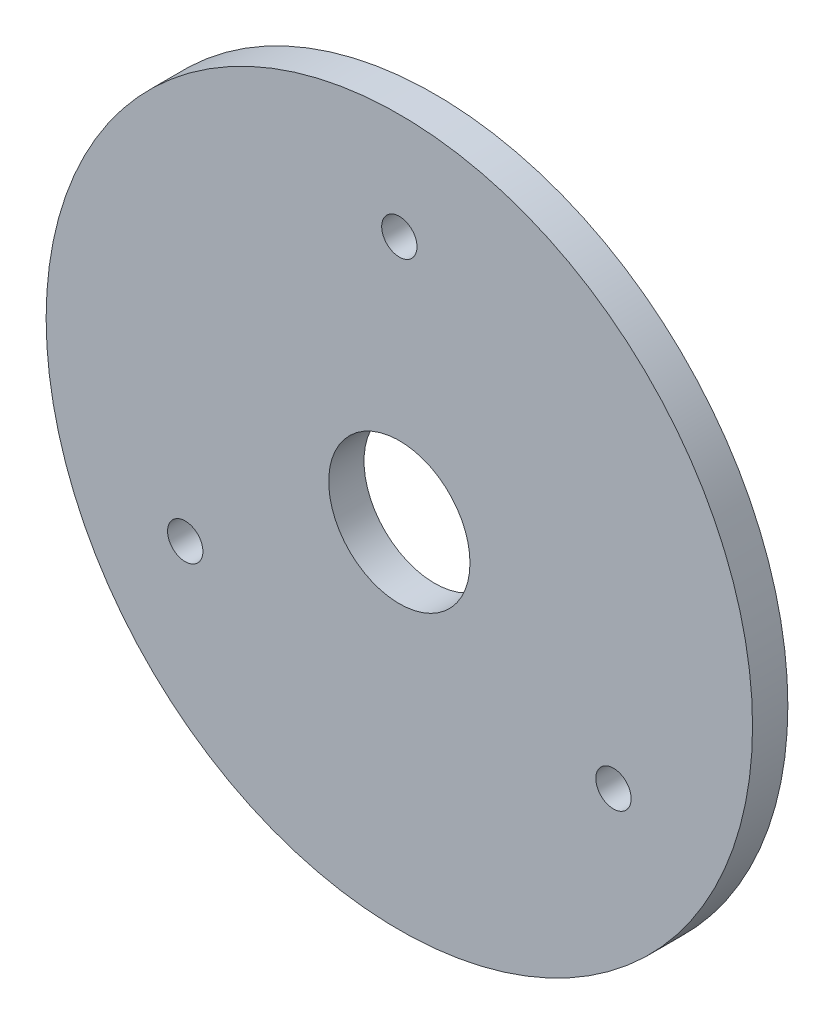
ISO-10303-21;
HEADER;
FILE_DESCRIPTION(('STEP AP214'),'2;1');
FILE_NAME('part.step','',(''),(''),'','','');
FILE_SCHEMA(('AUTOMOTIVE_DESIGN { 1 0 10303 214 1 1 1 1 }'));
ENDSEC;
DATA;
#1=APPLICATION_CONTEXT('core data for automotive mechanical design processes');
#2=APPLICATION_PROTOCOL_DEFINITION('international standard','automotive_design',2000,#1);
#3=PRODUCT_CONTEXT('',#1,'mechanical');
#4=PRODUCT('Part','Part','',(#3));
#5=PRODUCT_RELATED_PRODUCT_CATEGORY('part','',(#4));
#6=PRODUCT_DEFINITION_FORMATION('','',#4);
#7=PRODUCT_DEFINITION_CONTEXT('part definition',#1,'design');
#8=PRODUCT_DEFINITION('design','',#6,#7);
#9=PRODUCT_DEFINITION_SHAPE('','',#8);
#10=(LENGTH_UNIT() NAMED_UNIT(*) SI_UNIT(.MILLI.,.METRE.));
#11=(NAMED_UNIT(*) PLANE_ANGLE_UNIT() SI_UNIT($,.RADIAN.));
#12=(NAMED_UNIT(*) SI_UNIT($,.STERADIAN.) SOLID_ANGLE_UNIT());
#13=UNCERTAINTY_MEASURE_WITH_UNIT(LENGTH_MEASURE(1.E-05),#10,'distance_accuracy_value','');
#14=(GEOMETRIC_REPRESENTATION_CONTEXT(3) GLOBAL_UNCERTAINTY_ASSIGNED_CONTEXT((#13)) GLOBAL_UNIT_ASSIGNED_CONTEXT((#10,
#11,#12)) REPRESENTATION_CONTEXT('',''));
#15=CARTESIAN_POINT('',(0.,0.,0.));
#16=DIRECTION('',(0.,0.,1.));
#17=DIRECTION('',(1.,0.,0.));
#18=AXIS2_PLACEMENT_3D('',#15,#16,#17);
#19=CARTESIAN_POINT('',(0.,0.,2.));
#20=DIRECTION('',(0.,0.,-1.));
#21=DIRECTION('',(-1.,0.,0.));
#22=AXIS2_PLACEMENT_3D('',#19,#20,#21);
#23=CYLINDRICAL_SURFACE('',#22,20.);
#24=CARTESIAN_POINT('',(0.,0.,2.));
#25=DIRECTION('',(0.,0.,1.));
#26=DIRECTION('',(1.,0.,0.));
#27=AXIS2_PLACEMENT_3D('',#24,#25,#26);
#28=CIRCLE('',#27,20.);
#29=CARTESIAN_POINT('',(20.,0.,2.));
#30=VERTEX_POINT('',#29);
#31=EDGE_CURVE('E10',#30,#30,#28,.T.);
#32=ORIENTED_EDGE('',*,*,#31,.F.);
#33=EDGE_LOOP('',(#32));
#34=FACE_BOUND('',#33,.T.);
#35=CARTESIAN_POINT('',(0.,0.,0.));
#36=DIRECTION('',(0.,0.,1.));
#37=DIRECTION('',(1.,0.,0.));
#38=AXIS2_PLACEMENT_3D('',#35,#36,#37);
#39=CIRCLE('',#38,20.);
#40=CARTESIAN_POINT('',(20.,0.,0.));
#41=VERTEX_POINT('',#40);
#42=EDGE_CURVE('E35',#41,#41,#39,.T.);
#43=ORIENTED_EDGE('',*,*,#42,.T.);
#44=EDGE_LOOP('',(#43));
#45=FACE_BOUND('',#44,.T.);
#46=ADVANCED_FACE('F32',(#34,#45),#23,.T.);
#47=CARTESIAN_POINT('',(0.,0.,2.));
#48=DIRECTION('',(0.,0.,1.));
#49=DIRECTION('',(1.,0.,0.));
#50=AXIS2_PLACEMENT_3D('',#47,#48,#49);
#51=PLANE('',#50);
#52=CARTESIAN_POINT('',(0.,0.,2.));
#53=DIRECTION('',(0.,0.,1.));
#54=DIRECTION('',(1.,0.,0.));
#55=AXIS2_PLACEMENT_3D('',#52,#53,#54);
#56=CIRCLE('',#55,4.);
#57=CARTESIAN_POINT('',(4.,0.,2.));
#58=VERTEX_POINT('',#57);
#59=EDGE_CURVE('E62',#58,#58,#56,.T.);
#60=ORIENTED_EDGE('',*,*,#59,.F.);
#61=EDGE_LOOP('',(#60));
#62=FACE_BOUND('',#61,.T.);
#63=CARTESIAN_POINT('',(12.1243556529822,-6.99999999999989,2.));
#64=DIRECTION('',(0.,0.,1.));
#65=DIRECTION('',(-0.499999999999992,-0.866025403784443,0.));
#66=AXIS2_PLACEMENT_3D('',#63,#64,#65);
#67=CIRCLE('',#66,1.);
#68=CARTESIAN_POINT('',(11.6243556529822,-7.86602540378433,2.));
#69=VERTEX_POINT('',#68);
#70=EDGE_CURVE('E56',#69,#69,#67,.T.);
#71=ORIENTED_EDGE('',*,*,#70,.F.);
#72=EDGE_LOOP('',(#71));
#73=FACE_BOUND('',#72,.T.);
#74=CARTESIAN_POINT('',(-12.1243556529821,-7.00000000000006,2.));
#75=DIRECTION('',(0.,0.,1.));
#76=DIRECTION('',(-0.500000000000004,0.866025403784436,0.));
#77=AXIS2_PLACEMENT_3D('',#74,#75,#76);
#78=CIRCLE('',#77,1.);
#79=CARTESIAN_POINT('',(-12.6243556529821,-6.13397459621562,2.));
#80=VERTEX_POINT('',#79);
#81=EDGE_CURVE('E50',#80,#80,#78,.T.);
#82=ORIENTED_EDGE('',*,*,#81,.F.);
#83=EDGE_LOOP('',(#82));
#84=FACE_BOUND('',#83,.T.);
#85=CARTESIAN_POINT('',(0.,14.,2.));
#86=DIRECTION('',(0.,0.,1.));
#87=DIRECTION('',(1.,0.,0.));
#88=AXIS2_PLACEMENT_3D('',#85,#86,#87);
#89=CIRCLE('',#88,1.);
#90=CARTESIAN_POINT('',(1.,14.,2.));
#91=VERTEX_POINT('',#90);
#92=EDGE_CURVE('E44',#91,#91,#89,.T.);
#93=ORIENTED_EDGE('',*,*,#92,.F.);
#94=EDGE_LOOP('',(#93));
#95=FACE_BOUND('',#94,.T.);
#96=ORIENTED_EDGE('',*,*,#31,.T.);
#97=EDGE_LOOP('',(#96));
#98=FACE_BOUND('',#97,.T.);
#99=ADVANCED_FACE('F78',(#62,#73,#84,#95,#98),#51,.T.);
#100=CARTESIAN_POINT('',(0.,0.,0.));
#101=DIRECTION('',(0.,0.,1.));
#102=DIRECTION('',(1.,0.,0.));
#103=AXIS2_PLACEMENT_3D('',#100,#101,#102);
#104=PLANE('',#103);
#105=CARTESIAN_POINT('',(0.,0.,0.));
#106=DIRECTION('',(0.,0.,1.));
#107=DIRECTION('',(1.,0.,0.));
#108=AXIS2_PLACEMENT_3D('',#105,#106,#107);
#109=CIRCLE('',#108,4.);
#110=CARTESIAN_POINT('',(4.,0.,0.));
#111=VERTEX_POINT('',#110);
#112=EDGE_CURVE('E59',#111,#111,#109,.T.);
#113=ORIENTED_EDGE('',*,*,#112,.T.);
#114=EDGE_LOOP('',(#113));
#115=FACE_BOUND('',#114,.T.);
#116=CARTESIAN_POINT('',(12.1243556529822,-6.99999999999989,0.));
#117=DIRECTION('',(0.,0.,1.));
#118=DIRECTION('',(-0.499999999999992,-0.866025403784443,0.));
#119=AXIS2_PLACEMENT_3D('',#116,#117,#118);
#120=CIRCLE('',#119,1.);
#121=CARTESIAN_POINT('',(11.6243556529822,-7.86602540378433,0.));
#122=VERTEX_POINT('',#121);
#123=EDGE_CURVE('E53',#122,#122,#120,.T.);
#124=ORIENTED_EDGE('',*,*,#123,.T.);
#125=EDGE_LOOP('',(#124));
#126=FACE_BOUND('',#125,.T.);
#127=CARTESIAN_POINT('',(-12.1243556529821,-7.00000000000006,0.));
#128=DIRECTION('',(0.,0.,1.));
#129=DIRECTION('',(-0.500000000000004,0.866025403784436,0.));
#130=AXIS2_PLACEMENT_3D('',#127,#128,#129);
#131=CIRCLE('',#130,1.);
#132=CARTESIAN_POINT('',(-12.6243556529821,-6.13397459621562,0.));
#133=VERTEX_POINT('',#132);
#134=EDGE_CURVE('E47',#133,#133,#131,.T.);
#135=ORIENTED_EDGE('',*,*,#134,.T.);
#136=EDGE_LOOP('',(#135));
#137=FACE_BOUND('',#136,.T.);
#138=CARTESIAN_POINT('',(0.,14.,0.));
#139=DIRECTION('',(0.,0.,1.));
#140=DIRECTION('',(1.,0.,0.));
#141=AXIS2_PLACEMENT_3D('',#138,#139,#140);
#142=CIRCLE('',#141,1.);
#143=CARTESIAN_POINT('',(1.,14.,0.));
#144=VERTEX_POINT('',#143);
#145=EDGE_CURVE('E42',#144,#144,#142,.T.);
#146=ORIENTED_EDGE('',*,*,#145,.T.);
#147=EDGE_LOOP('',(#146));
#148=FACE_BOUND('',#147,.T.);
#149=ORIENTED_EDGE('',*,*,#42,.F.);
#150=EDGE_LOOP('',(#149));
#151=FACE_BOUND('',#150,.T.);
#152=ADVANCED_FACE('F68',(#115,#126,#137,#148,#151),#104,.F.);
#153=CARTESIAN_POINT('',(0.,14.,0.));
#154=DIRECTION('',(0.,0.,1.));
#155=DIRECTION('',(1.,0.,0.));
#156=AXIS2_PLACEMENT_3D('',#153,#154,#155);
#157=CYLINDRICAL_SURFACE('',#156,1.);
#158=ORIENTED_EDGE('',*,*,#145,.F.);
#159=EDGE_LOOP('',(#158));
#160=FACE_BOUND('',#159,.T.);
#161=ORIENTED_EDGE('',*,*,#92,.T.);
#162=EDGE_LOOP('',(#161));
#163=FACE_BOUND('',#162,.T.);
#164=ADVANCED_FACE('F88',(#160,#163),#157,.F.);
#165=CARTESIAN_POINT('',(-12.1243556529821,-7.00000000000006,0.));
#166=DIRECTION('',(0.,0.,1.));
#167=DIRECTION('',(1.,0.,0.));
#168=AXIS2_PLACEMENT_3D('',#165,#166,#167);
#169=CYLINDRICAL_SURFACE('',#168,1.);
#170=ORIENTED_EDGE('',*,*,#134,.F.);
#171=EDGE_LOOP('',(#170));
#172=FACE_BOUND('',#171,.T.);
#173=ORIENTED_EDGE('',*,*,#81,.T.);
#174=EDGE_LOOP('',(#173));
#175=FACE_BOUND('',#174,.T.);
#176=ADVANCED_FACE('F90',(#172,#175),#169,.F.);
#177=CARTESIAN_POINT('',(12.1243556529822,-6.99999999999989,0.));
#178=DIRECTION('',(0.,0.,1.));
#179=DIRECTION('',(1.,0.,0.));
#180=AXIS2_PLACEMENT_3D('',#177,#178,#179);
#181=CYLINDRICAL_SURFACE('',#180,1.);
#182=ORIENTED_EDGE('',*,*,#123,.F.);
#183=EDGE_LOOP('',(#182));
#184=FACE_BOUND('',#183,.T.);
#185=ORIENTED_EDGE('',*,*,#70,.T.);
#186=EDGE_LOOP('',(#185));
#187=FACE_BOUND('',#186,.T.);
#188=ADVANCED_FACE('F74',(#184,#187),#181,.F.);
#189=CARTESIAN_POINT('',(0.,0.,0.));
#190=DIRECTION('',(0.,0.,1.));
#191=DIRECTION('',(1.,0.,0.));
#192=AXIS2_PLACEMENT_3D('',#189,#190,#191);
#193=CYLINDRICAL_SURFACE('',#192,4.);
#194=ORIENTED_EDGE('',*,*,#112,.F.);
#195=EDGE_LOOP('',(#194));
#196=FACE_BOUND('',#195,.T.);
#197=ORIENTED_EDGE('',*,*,#59,.T.);
#198=EDGE_LOOP('',(#197));
#199=FACE_BOUND('',#198,.T.);
#200=ADVANCED_FACE('F71',(#196,#199),#193,.F.);
#201=CLOSED_SHELL('',(#46,#99,#152,#164,#176,#188,#200));
#202=MANIFOLD_SOLID_BREP('B2',#201);
#203=ADVANCED_BREP_SHAPE_REPRESENTATION('',(#18,#202),#14);
#204=SHAPE_DEFINITION_REPRESENTATION(#9,#203);
ENDSEC;
END-ISO-10303-21;
